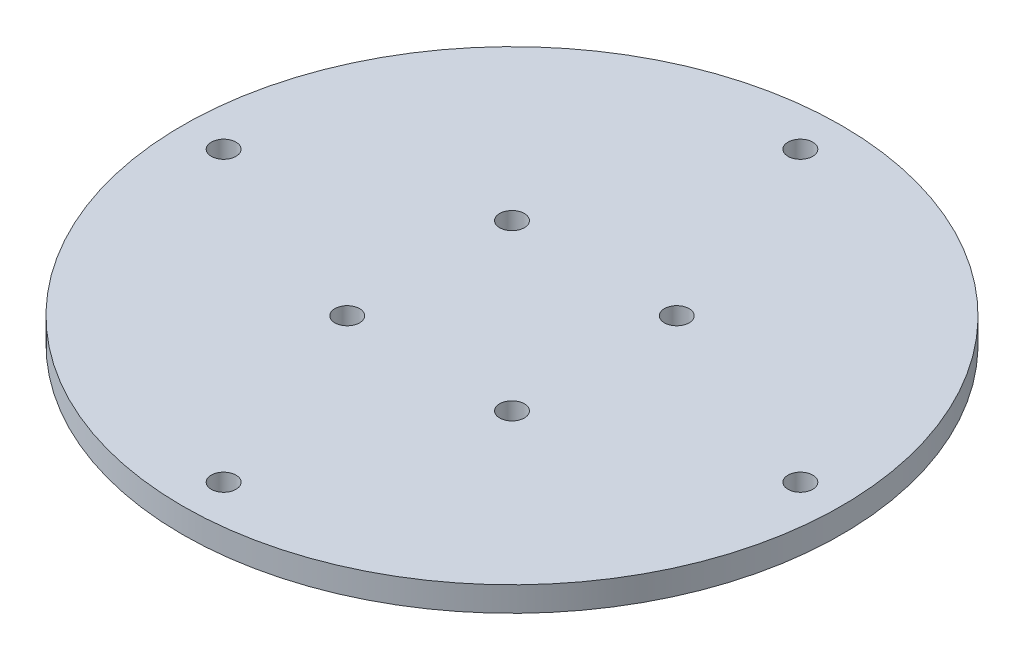
ISO-10303-21;
HEADER;
FILE_DESCRIPTION(('STEP AP214'),'2;1');
FILE_NAME('part.step','',(''),(''),'','','');
FILE_SCHEMA(('AUTOMOTIVE_DESIGN { 1 0 10303 214 1 1 1 1 }'));
ENDSEC;
DATA;
#1=APPLICATION_CONTEXT('core data for automotive mechanical design processes');
#2=APPLICATION_PROTOCOL_DEFINITION('international standard','automotive_design',2000,#1);
#3=PRODUCT_CONTEXT('',#1,'mechanical');
#4=PRODUCT('Part','Part','',(#3));
#5=PRODUCT_RELATED_PRODUCT_CATEGORY('part','',(#4));
#6=PRODUCT_DEFINITION_FORMATION('','',#4);
#7=PRODUCT_DEFINITION_CONTEXT('part definition',#1,'design');
#8=PRODUCT_DEFINITION('design','',#6,#7);
#9=PRODUCT_DEFINITION_SHAPE('','',#8);
#10=(LENGTH_UNIT() NAMED_UNIT(*) SI_UNIT(.MILLI.,.METRE.));
#11=(NAMED_UNIT(*) PLANE_ANGLE_UNIT() SI_UNIT($,.RADIAN.));
#12=(NAMED_UNIT(*) SI_UNIT($,.STERADIAN.) SOLID_ANGLE_UNIT());
#13=UNCERTAINTY_MEASURE_WITH_UNIT(LENGTH_MEASURE(1.E-05),#10,'distance_accuracy_value','');
#14=(GEOMETRIC_REPRESENTATION_CONTEXT(3) GLOBAL_UNCERTAINTY_ASSIGNED_CONTEXT((#13)) GLOBAL_UNIT_ASSIGNED_CONTEXT((#10,
#11,#12)) REPRESENTATION_CONTEXT('',''));
#15=CARTESIAN_POINT('',(0.,0.,0.));
#16=DIRECTION('',(0.,0.,1.));
#17=DIRECTION('',(1.,0.,0.));
#18=AXIS2_PLACEMENT_3D('',#15,#16,#17);
#19=CARTESIAN_POINT('',(0.,3.,0.));
#20=DIRECTION('',(0.,1.,0.));
#21=DIRECTION('',(0.,0.,1.));
#22=AXIS2_PLACEMENT_3D('',#19,#20,#21);
#23=PLANE('',#22);
#24=CARTESIAN_POINT('',(10.,3.,10.));
#25=DIRECTION('',(0.,1.,0.));
#26=DIRECTION('',(0.,0.,1.));
#27=AXIS2_PLACEMENT_3D('',#24,#25,#26);
#28=CIRCLE('',#27,1.5);
#29=CARTESIAN_POINT('',(10.,3.,11.5));
#30=VERTEX_POINT('',#29);
#31=EDGE_CURVE('E73',#30,#30,#28,.T.);
#32=ORIENTED_EDGE('',*,*,#31,.F.);
#33=EDGE_LOOP('',(#32));
#34=FACE_BOUND('',#33,.T.);
#35=CARTESIAN_POINT('',(-10.,3.,10.));
#36=DIRECTION('',(0.,1.,0.));
#37=DIRECTION('',(0.,0.,1.));
#38=AXIS2_PLACEMENT_3D('',#35,#36,#37);
#39=CIRCLE('',#38,1.5);
#40=CARTESIAN_POINT('',(-10.,3.,11.5));
#41=VERTEX_POINT('',#40);
#42=EDGE_CURVE('E79',#41,#41,#39,.T.);
#43=ORIENTED_EDGE('',*,*,#42,.F.);
#44=EDGE_LOOP('',(#43));
#45=FACE_BOUND('',#44,.T.);
#46=CARTESIAN_POINT('',(-10.,3.,-10.));
#47=DIRECTION('',(0.,1.,0.));
#48=DIRECTION('',(0.,0.,1.));
#49=AXIS2_PLACEMENT_3D('',#46,#47,#48);
#50=CIRCLE('',#49,1.5);
#51=CARTESIAN_POINT('',(-10.,3.,-8.5));
#52=VERTEX_POINT('',#51);
#53=EDGE_CURVE('E85',#52,#52,#50,.T.);
#54=ORIENTED_EDGE('',*,*,#53,.F.);
#55=EDGE_LOOP('',(#54));
#56=FACE_BOUND('',#55,.T.);
#57=CARTESIAN_POINT('',(10.,3.,-10.));
#58=DIRECTION('',(0.,1.,0.));
#59=DIRECTION('',(0.,0.,1.));
#60=AXIS2_PLACEMENT_3D('',#57,#58,#59);
#61=CIRCLE('',#60,1.5);
#62=CARTESIAN_POINT('',(10.,3.,-8.5));
#63=VERTEX_POINT('',#62);
#64=EDGE_CURVE('E67',#63,#63,#61,.T.);
#65=ORIENTED_EDGE('',*,*,#64,.F.);
#66=EDGE_LOOP('',(#65));
#67=FACE_BOUND('',#66,.T.);
#68=CARTESIAN_POINT('',(0.,3.,35.));
#69=DIRECTION('',(0.,1.,0.));
#70=DIRECTION('',(0.,0.,1.));
#71=AXIS2_PLACEMENT_3D('',#68,#69,#70);
#72=CIRCLE('',#71,1.5);
#73=CARTESIAN_POINT('',(0.,3.,36.5));
#74=VERTEX_POINT('',#73);
#75=EDGE_CURVE('E52',#74,#74,#72,.T.);
#76=ORIENTED_EDGE('',*,*,#75,.F.);
#77=EDGE_LOOP('',(#76));
#78=FACE_BOUND('',#77,.T.);
#79=CARTESIAN_POINT('',(0.,3.,-35.));
#80=DIRECTION('',(0.,1.,0.));
#81=DIRECTION('',(0.,0.,1.));
#82=AXIS2_PLACEMENT_3D('',#79,#80,#81);
#83=CIRCLE('',#82,1.5);
#84=CARTESIAN_POINT('',(0.,3.,-33.5));
#85=VERTEX_POINT('',#84);
#86=EDGE_CURVE('E41',#85,#85,#83,.T.);
#87=ORIENTED_EDGE('',*,*,#86,.F.);
#88=EDGE_LOOP('',(#87));
#89=FACE_BOUND('',#88,.T.);
#90=CARTESIAN_POINT('',(0.,3.,0.));
#91=DIRECTION('',(0.,1.,0.));
#92=DIRECTION('',(0.,0.,1.));
#93=AXIS2_PLACEMENT_3D('',#90,#91,#92);
#94=CIRCLE('',#93,40.);
#95=CARTESIAN_POINT('',(0.,3.,40.));
#96=VERTEX_POINT('',#95);
#97=EDGE_CURVE('E10',#96,#96,#94,.T.);
#98=ORIENTED_EDGE('',*,*,#97,.T.);
#99=EDGE_LOOP('',(#98));
#100=FACE_BOUND('',#99,.T.);
#101=CARTESIAN_POINT('',(35.,3.,0.));
#102=DIRECTION('',(0.,1.,0.));
#103=DIRECTION('',(0.,0.,1.));
#104=AXIS2_PLACEMENT_3D('',#101,#102,#103);
#105=CIRCLE('',#104,1.5);
#106=CARTESIAN_POINT('',(35.,3.,1.5));
#107=VERTEX_POINT('',#106);
#108=EDGE_CURVE('E46',#107,#107,#105,.T.);
#109=ORIENTED_EDGE('',*,*,#108,.F.);
#110=EDGE_LOOP('',(#109));
#111=FACE_BOUND('',#110,.T.);
#112=CARTESIAN_POINT('',(-35.,3.,0.));
#113=DIRECTION('',(0.,1.,0.));
#114=DIRECTION('',(0.,0.,1.));
#115=AXIS2_PLACEMENT_3D('',#112,#113,#114);
#116=CIRCLE('',#115,1.5);
#117=CARTESIAN_POINT('',(-35.,3.,1.5));
#118=VERTEX_POINT('',#117);
#119=EDGE_CURVE('E58',#118,#118,#116,.T.);
#120=ORIENTED_EDGE('',*,*,#119,.F.);
#121=EDGE_LOOP('',(#120));
#122=FACE_BOUND('',#121,.T.);
#123=ADVANCED_FACE('F30',(#34,#45,#56,#67,#78,#89,#100,#111,#122),#23,.T.);
#124=CARTESIAN_POINT('',(0.,0.,0.));
#125=DIRECTION('',(0.,1.,0.));
#126=DIRECTION('',(0.,0.,1.));
#127=AXIS2_PLACEMENT_3D('',#124,#125,#126);
#128=PLANE('',#127);
#129=CARTESIAN_POINT('',(10.,0.,10.));
#130=DIRECTION('',(0.,1.,0.));
#131=DIRECTION('',(0.,0.,1.));
#132=AXIS2_PLACEMENT_3D('',#129,#130,#131);
#133=CIRCLE('',#132,1.5);
#134=CARTESIAN_POINT('',(10.,0.,11.5));
#135=VERTEX_POINT('',#134);
#136=EDGE_CURVE('E76',#135,#135,#133,.T.);
#137=ORIENTED_EDGE('',*,*,#136,.T.);
#138=EDGE_LOOP('',(#137));
#139=FACE_BOUND('',#138,.T.);
#140=CARTESIAN_POINT('',(-10.,0.,10.));
#141=DIRECTION('',(0.,1.,0.));
#142=DIRECTION('',(0.,0.,1.));
#143=AXIS2_PLACEMENT_3D('',#140,#141,#142);
#144=CIRCLE('',#143,1.5);
#145=CARTESIAN_POINT('',(-10.,0.,11.5));
#146=VERTEX_POINT('',#145);
#147=EDGE_CURVE('E82',#146,#146,#144,.T.);
#148=ORIENTED_EDGE('',*,*,#147,.T.);
#149=EDGE_LOOP('',(#148));
#150=FACE_BOUND('',#149,.T.);
#151=CARTESIAN_POINT('',(-10.,0.,-10.));
#152=DIRECTION('',(0.,1.,0.));
#153=DIRECTION('',(0.,0.,1.));
#154=AXIS2_PLACEMENT_3D('',#151,#152,#153);
#155=CIRCLE('',#154,1.5);
#156=CARTESIAN_POINT('',(-10.,0.,-8.5));
#157=VERTEX_POINT('',#156);
#158=EDGE_CURVE('E70',#157,#157,#155,.T.);
#159=ORIENTED_EDGE('',*,*,#158,.T.);
#160=EDGE_LOOP('',(#159));
#161=FACE_BOUND('',#160,.T.);
#162=CARTESIAN_POINT('',(10.,0.,-10.));
#163=DIRECTION('',(0.,1.,0.));
#164=DIRECTION('',(0.,0.,1.));
#165=AXIS2_PLACEMENT_3D('',#162,#163,#164);
#166=CIRCLE('',#165,1.5);
#167=CARTESIAN_POINT('',(10.,0.,-8.5));
#168=VERTEX_POINT('',#167);
#169=EDGE_CURVE('E64',#168,#168,#166,.T.);
#170=ORIENTED_EDGE('',*,*,#169,.T.);
#171=EDGE_LOOP('',(#170));
#172=FACE_BOUND('',#171,.T.);
#173=CARTESIAN_POINT('',(0.,0.,0.));
#174=DIRECTION('',(0.,1.,0.));
#175=DIRECTION('',(0.,0.,1.));
#176=AXIS2_PLACEMENT_3D('',#173,#174,#175);
#177=CIRCLE('',#176,40.);
#178=CARTESIAN_POINT('',(0.,0.,40.));
#179=VERTEX_POINT('',#178);
#180=EDGE_CURVE('E34',#179,#179,#177,.T.);
#181=ORIENTED_EDGE('',*,*,#180,.F.);
#182=EDGE_LOOP('',(#181));
#183=FACE_BOUND('',#182,.T.);
#184=CARTESIAN_POINT('',(0.,0.,-35.));
#185=DIRECTION('',(0.,1.,0.));
#186=DIRECTION('',(0.,0.,1.));
#187=AXIS2_PLACEMENT_3D('',#184,#185,#186);
#188=CIRCLE('',#187,1.5);
#189=CARTESIAN_POINT('',(0.,0.,-33.5));
#190=VERTEX_POINT('',#189);
#191=EDGE_CURVE('E43',#190,#190,#188,.T.);
#192=ORIENTED_EDGE('',*,*,#191,.T.);
#193=EDGE_LOOP('',(#192));
#194=FACE_BOUND('',#193,.T.);
#195=CARTESIAN_POINT('',(35.,0.,0.));
#196=DIRECTION('',(0.,1.,0.));
#197=DIRECTION('',(0.,0.,1.));
#198=AXIS2_PLACEMENT_3D('',#195,#196,#197);
#199=CIRCLE('',#198,1.5);
#200=CARTESIAN_POINT('',(35.,0.,1.5));
#201=VERTEX_POINT('',#200);
#202=EDGE_CURVE('E49',#201,#201,#199,.T.);
#203=ORIENTED_EDGE('',*,*,#202,.T.);
#204=EDGE_LOOP('',(#203));
#205=FACE_BOUND('',#204,.T.);
#206=CARTESIAN_POINT('',(0.,0.,35.));
#207=DIRECTION('',(0.,1.,0.));
#208=DIRECTION('',(0.,0.,1.));
#209=AXIS2_PLACEMENT_3D('',#206,#207,#208);
#210=CIRCLE('',#209,1.5);
#211=CARTESIAN_POINT('',(0.,0.,36.5));
#212=VERTEX_POINT('',#211);
#213=EDGE_CURVE('E55',#212,#212,#210,.T.);
#214=ORIENTED_EDGE('',*,*,#213,.T.);
#215=EDGE_LOOP('',(#214));
#216=FACE_BOUND('',#215,.T.);
#217=CARTESIAN_POINT('',(-35.,0.,0.));
#218=DIRECTION('',(0.,1.,0.));
#219=DIRECTION('',(0.,0.,1.));
#220=AXIS2_PLACEMENT_3D('',#217,#218,#219);
#221=CIRCLE('',#220,1.5);
#222=CARTESIAN_POINT('',(-35.,0.,1.5));
#223=VERTEX_POINT('',#222);
#224=EDGE_CURVE('E61',#223,#223,#221,.T.);
#225=ORIENTED_EDGE('',*,*,#224,.T.);
#226=EDGE_LOOP('',(#225));
#227=FACE_BOUND('',#226,.T.);
#228=ADVANCED_FACE('F91',(#139,#150,#161,#172,#183,#194,#205,#216,#227),#128,.F.);
#229=CARTESIAN_POINT('',(0.,3.,0.));
#230=DIRECTION('',(0.,-1.,0.));
#231=DIRECTION('',(0.,0.,-1.));
#232=AXIS2_PLACEMENT_3D('',#229,#230,#231);
#233=CYLINDRICAL_SURFACE('',#232,40.);
#234=ORIENTED_EDGE('',*,*,#97,.F.);
#235=EDGE_LOOP('',(#234));
#236=FACE_BOUND('',#235,.T.);
#237=ORIENTED_EDGE('',*,*,#180,.T.);
#238=EDGE_LOOP('',(#237));
#239=FACE_BOUND('',#238,.T.);
#240=ADVANCED_FACE('F32',(#236,#239),#233,.T.);
#241=CARTESIAN_POINT('',(0.,3.,-35.));
#242=DIRECTION('',(0.,-1.,0.));
#243=DIRECTION('',(0.,0.,-1.));
#244=AXIS2_PLACEMENT_3D('',#241,#242,#243);
#245=CYLINDRICAL_SURFACE('',#244,1.5);
#246=ORIENTED_EDGE('',*,*,#86,.T.);
#247=EDGE_LOOP('',(#246));
#248=FACE_BOUND('',#247,.T.);
#249=ORIENTED_EDGE('',*,*,#191,.F.);
#250=EDGE_LOOP('',(#249));
#251=FACE_BOUND('',#250,.T.);
#252=ADVANCED_FACE('F128',(#248,#251),#245,.F.);
#253=CARTESIAN_POINT('',(35.,3.,0.));
#254=DIRECTION('',(0.,-1.,0.));
#255=DIRECTION('',(0.,0.,-1.));
#256=AXIS2_PLACEMENT_3D('',#253,#254,#255);
#257=CYLINDRICAL_SURFACE('',#256,1.5);
#258=ORIENTED_EDGE('',*,*,#108,.T.);
#259=EDGE_LOOP('',(#258));
#260=FACE_BOUND('',#259,.T.);
#261=ORIENTED_EDGE('',*,*,#202,.F.);
#262=EDGE_LOOP('',(#261));
#263=FACE_BOUND('',#262,.T.);
#264=ADVANCED_FACE('F134',(#260,#263),#257,.F.);
#265=CARTESIAN_POINT('',(0.,3.,35.));
#266=DIRECTION('',(0.,-1.,0.));
#267=DIRECTION('',(0.,0.,-1.));
#268=AXIS2_PLACEMENT_3D('',#265,#266,#267);
#269=CYLINDRICAL_SURFACE('',#268,1.5);
#270=ORIENTED_EDGE('',*,*,#75,.T.);
#271=EDGE_LOOP('',(#270));
#272=FACE_BOUND('',#271,.T.);
#273=ORIENTED_EDGE('',*,*,#213,.F.);
#274=EDGE_LOOP('',(#273));
#275=FACE_BOUND('',#274,.T.);
#276=ADVANCED_FACE('F119',(#272,#275),#269,.F.);
#277=CARTESIAN_POINT('',(-35.,3.,0.));
#278=DIRECTION('',(0.,-1.,0.));
#279=DIRECTION('',(0.,0.,-1.));
#280=AXIS2_PLACEMENT_3D('',#277,#278,#279);
#281=CYLINDRICAL_SURFACE('',#280,1.5);
#282=ORIENTED_EDGE('',*,*,#119,.T.);
#283=EDGE_LOOP('',(#282));
#284=FACE_BOUND('',#283,.T.);
#285=ORIENTED_EDGE('',*,*,#224,.F.);
#286=EDGE_LOOP('',(#285));
#287=FACE_BOUND('',#286,.T.);
#288=ADVANCED_FACE('F116',(#284,#287),#281,.F.);
#289=CARTESIAN_POINT('',(10.,0.,-10.));
#290=DIRECTION('',(0.,1.,0.));
#291=DIRECTION('',(0.,0.,1.));
#292=AXIS2_PLACEMENT_3D('',#289,#290,#291);
#293=CYLINDRICAL_SURFACE('',#292,1.5);
#294=ORIENTED_EDGE('',*,*,#169,.F.);
#295=EDGE_LOOP('',(#294));
#296=FACE_BOUND('',#295,.T.);
#297=ORIENTED_EDGE('',*,*,#64,.T.);
#298=EDGE_LOOP('',(#297));
#299=FACE_BOUND('',#298,.T.);
#300=ADVANCED_FACE('F98',(#296,#299),#293,.F.);
#301=CARTESIAN_POINT('',(-10.,0.,-10.));
#302=DIRECTION('',(0.,1.,0.));
#303=DIRECTION('',(0.,0.,1.));
#304=AXIS2_PLACEMENT_3D('',#301,#302,#303);
#305=CYLINDRICAL_SURFACE('',#304,1.5);
#306=ORIENTED_EDGE('',*,*,#158,.F.);
#307=EDGE_LOOP('',(#306));
#308=FACE_BOUND('',#307,.T.);
#309=ORIENTED_EDGE('',*,*,#53,.T.);
#310=EDGE_LOOP('',(#309));
#311=FACE_BOUND('',#310,.T.);
#312=ADVANCED_FACE('F94',(#308,#311),#305,.F.);
#313=CARTESIAN_POINT('',(-10.,0.,10.));
#314=DIRECTION('',(0.,1.,0.));
#315=DIRECTION('',(0.,0.,1.));
#316=AXIS2_PLACEMENT_3D('',#313,#314,#315);
#317=CYLINDRICAL_SURFACE('',#316,1.5);
#318=ORIENTED_EDGE('',*,*,#147,.F.);
#319=EDGE_LOOP('',(#318));
#320=FACE_BOUND('',#319,.T.);
#321=ORIENTED_EDGE('',*,*,#42,.T.);
#322=EDGE_LOOP('',(#321));
#323=FACE_BOUND('',#322,.T.);
#324=ADVANCED_FACE('F97',(#320,#323),#317,.F.);
#325=CARTESIAN_POINT('',(10.,0.,10.));
#326=DIRECTION('',(0.,1.,0.));
#327=DIRECTION('',(0.,0.,1.));
#328=AXIS2_PLACEMENT_3D('',#325,#326,#327);
#329=CYLINDRICAL_SURFACE('',#328,1.5);
#330=ORIENTED_EDGE('',*,*,#136,.F.);
#331=EDGE_LOOP('',(#330));
#332=FACE_BOUND('',#331,.T.);
#333=ORIENTED_EDGE('',*,*,#31,.T.);
#334=EDGE_LOOP('',(#333));
#335=FACE_BOUND('',#334,.T.);
#336=ADVANCED_FACE('F145',(#332,#335),#329,.F.);
#337=CLOSED_SHELL('',(#123,#228,#240,#252,#264,#276,#288,#300,#312,#324,#336));
#338=MANIFOLD_SOLID_BREP('B2',#337);
#339=ADVANCED_BREP_SHAPE_REPRESENTATION('',(#18,#338),#14);
#340=SHAPE_DEFINITION_REPRESENTATION(#9,#339);
ENDSEC;
END-ISO-10303-21;
